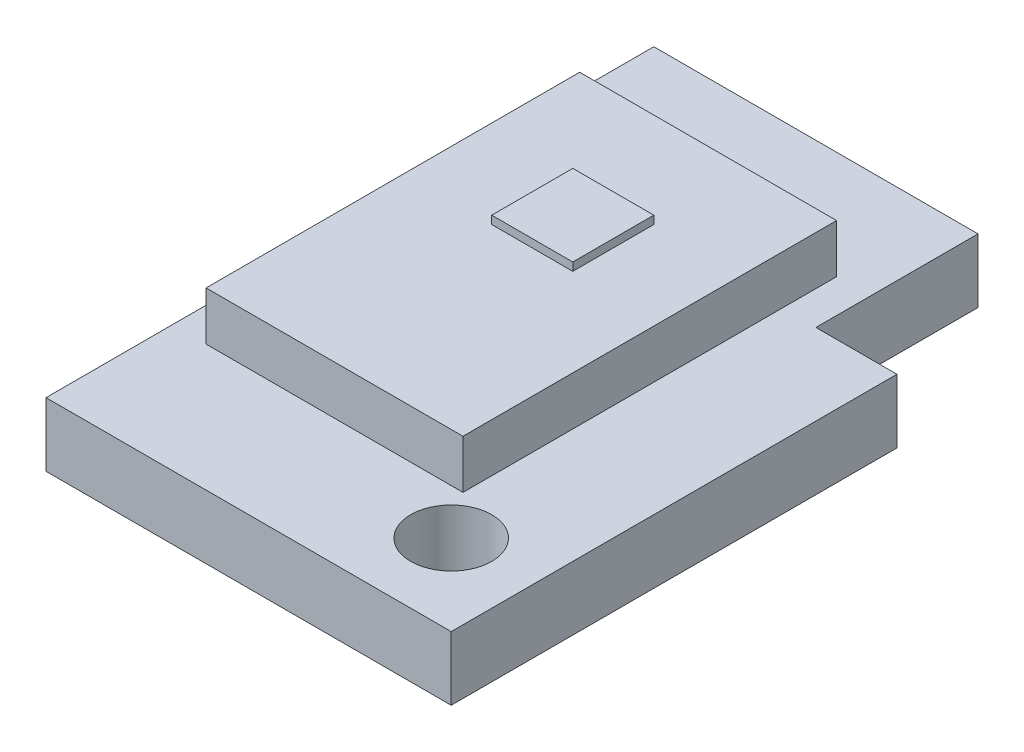
ISO-10303-21;
HEADER;
FILE_DESCRIPTION(('STEP AP214'),'2;1');
FILE_NAME('part.step','',(''),(''),'','','');
FILE_SCHEMA(('AUTOMOTIVE_DESIGN { 1 0 10303 214 1 1 1 1 }'));
ENDSEC;
DATA;
#1=APPLICATION_CONTEXT('core data for automotive mechanical design processes');
#2=APPLICATION_PROTOCOL_DEFINITION('international standard','automotive_design',2000,#1);
#3=PRODUCT_CONTEXT('',#1,'mechanical');
#4=PRODUCT('Part','Part','',(#3));
#5=PRODUCT_RELATED_PRODUCT_CATEGORY('part','',(#4));
#6=PRODUCT_DEFINITION_FORMATION('','',#4);
#7=PRODUCT_DEFINITION_CONTEXT('part definition',#1,'design');
#8=PRODUCT_DEFINITION('design','',#6,#7);
#9=PRODUCT_DEFINITION_SHAPE('','',#8);
#10=(LENGTH_UNIT() NAMED_UNIT(*) SI_UNIT(.MILLI.,.METRE.));
#11=(NAMED_UNIT(*) PLANE_ANGLE_UNIT() SI_UNIT($,.RADIAN.));
#12=(NAMED_UNIT(*) SI_UNIT($,.STERADIAN.) SOLID_ANGLE_UNIT());
#13=UNCERTAINTY_MEASURE_WITH_UNIT(LENGTH_MEASURE(1.E-05),#10,'distance_accuracy_value','');
#14=(GEOMETRIC_REPRESENTATION_CONTEXT(3) GLOBAL_UNCERTAINTY_ASSIGNED_CONTEXT((#13)) GLOBAL_UNIT_ASSIGNED_CONTEXT((#10,
#11,#12)) REPRESENTATION_CONTEXT('',''));
#15=CARTESIAN_POINT('',(0.,0.,0.));
#16=DIRECTION('',(0.,0.,1.));
#17=DIRECTION('',(1.,0.,0.));
#18=AXIS2_PLACEMENT_3D('',#15,#16,#17);
#19=CARTESIAN_POINT('',(0.,1.3874,0.));
#20=DIRECTION('',(0.,1.,0.));
#21=DIRECTION('',(0.,0.,1.));
#22=AXIS2_PLACEMENT_3D('',#19,#20,#21);
#23=PLANE('',#22);
#24=DIRECTION('',(0.,0.,1.));
#25=VECTOR('',#24,1.);
#26=CARTESIAN_POINT('',(-1.585,1.3874,2.94));
#27=LINE('',#26,#25);
#28=CARTESIAN_POINT('',(-1.585,1.3874,-1.67));
#29=VERTEX_POINT('',#28);
#30=CARTESIAN_POINT('',(-1.585,1.3874,2.94));
#31=VERTEX_POINT('',#30);
#32=EDGE_CURVE('E166',#29,#31,#27,.T.);
#33=ORIENTED_EDGE('',*,*,#32,.T.);
#34=DIRECTION('',(1.,0.,0.));
#35=VECTOR('',#34,1.);
#36=CARTESIAN_POINT('',(1.585,1.3874,2.94));
#37=LINE('',#36,#35);
#38=CARTESIAN_POINT('',(1.585,1.3874,2.94));
#39=VERTEX_POINT('',#38);
#40=EDGE_CURVE('E169',#31,#39,#37,.T.);
#41=ORIENTED_EDGE('',*,*,#40,.T.);
#42=DIRECTION('',(0.,0.,-1.));
#43=VECTOR('',#42,1.);
#44=CARTESIAN_POINT('',(1.585,1.3874,2.94));
#45=LINE('',#44,#43);
#46=CARTESIAN_POINT('',(1.585,1.3874,-1.67));
#47=VERTEX_POINT('',#46);
#48=EDGE_CURVE('E172',#39,#47,#45,.T.);
#49=ORIENTED_EDGE('',*,*,#48,.T.);
#50=DIRECTION('',(-1.,0.,0.));
#51=VECTOR('',#50,1.);
#52=CARTESIAN_POINT('',(1.585,1.3874,-1.67));
#53=LINE('',#52,#51);
#54=EDGE_CURVE('E174',#47,#29,#53,.T.);
#55=ORIENTED_EDGE('',*,*,#54,.T.);
#56=EDGE_LOOP('',(#33,#41,#49,#55));
#57=FACE_BOUND('',#56,.T.);
#58=DIRECTION('',(-1.,0.,0.));
#59=VECTOR('',#58,1.);
#60=CARTESIAN_POINT('',(-0.500000000000001,1.3874,-0.5));
#61=LINE('',#60,#59);
#62=CARTESIAN_POINT('',(0.499999999999999,1.3874,-0.5));
#63=VERTEX_POINT('',#62);
#64=CARTESIAN_POINT('',(-0.500000000000001,1.3874,-0.5));
#65=VERTEX_POINT('',#64);
#66=EDGE_CURVE('E450',#63,#65,#61,.T.);
#67=ORIENTED_EDGE('',*,*,#66,.F.);
#68=DIRECTION('',(0.,0.,-1.));
#69=VECTOR('',#68,1.);
#70=CARTESIAN_POINT('',(0.499999999999999,1.3874,0.5));
#71=LINE('',#70,#69);
#72=CARTESIAN_POINT('',(0.499999999999999,1.3874,0.5));
#73=VERTEX_POINT('',#72);
#74=EDGE_CURVE('E157',#73,#63,#71,.T.);
#75=ORIENTED_EDGE('',*,*,#74,.F.);
#76=DIRECTION('',(1.,0.,0.));
#77=VECTOR('',#76,1.);
#78=CARTESIAN_POINT('',(-0.500000000000001,1.3874,0.5));
#79=LINE('',#78,#77);
#80=CARTESIAN_POINT('',(-0.500000000000001,1.3874,0.5));
#81=VERTEX_POINT('',#80);
#82=EDGE_CURVE('E153',#81,#73,#79,.T.);
#83=ORIENTED_EDGE('',*,*,#82,.F.);
#84=DIRECTION('',(0.,0.,1.));
#85=VECTOR('',#84,1.);
#86=CARTESIAN_POINT('',(-0.500000000000001,1.3874,0.5));
#87=LINE('',#86,#85);
#88=EDGE_CURVE('E452',#65,#81,#87,.T.);
#89=ORIENTED_EDGE('',*,*,#88,.F.);
#90=EDGE_LOOP('',(#67,#75,#83,#89));
#91=FACE_BOUND('',#90,.T.);
#92=ADVANCED_FACE('F33',(#57,#91),#23,.T.);
#93=CARTESIAN_POINT('',(0.,0.7874,0.));
#94=DIRECTION('',(0.,-1.,0.));
#95=DIRECTION('',(0.,0.,-1.));
#96=AXIS2_PLACEMENT_3D('',#93,#94,#95);
#97=PLANE('',#96);
#98=CARTESIAN_POINT('',(2.,0.7874,3.5));
#99=DIRECTION('',(0.,1.,0.));
#100=DIRECTION('',(0.,0.,1.));
#101=AXIS2_PLACEMENT_3D('',#98,#99,#100);
#102=CIRCLE('',#101,0.5);
#103=CARTESIAN_POINT('',(2.,0.7874,4.));
#104=VERTEX_POINT('',#103);
#105=EDGE_CURVE('E442',#104,#104,#102,.T.);
#106=ORIENTED_EDGE('',*,*,#105,.F.);
#107=EDGE_LOOP('',(#106));
#108=FACE_BOUND('',#107,.T.);
#109=DIRECTION('',(0.,0.,1.));
#110=VECTOR('',#109,1.);
#111=CARTESIAN_POINT('',(-2.,0.7874,-3.));
#112=LINE('',#111,#110);
#113=CARTESIAN_POINT('',(-2.,0.7874,-3.));
#114=VERTEX_POINT('',#113);
#115=CARTESIAN_POINT('',(-2.,0.7874,4.5));
#116=VERTEX_POINT('',#115);
#117=EDGE_CURVE('E194',#114,#116,#112,.T.);
#118=ORIENTED_EDGE('',*,*,#117,.T.);
#119=DIRECTION('',(1.,0.,0.));
#120=VECTOR('',#119,1.);
#121=CARTESIAN_POINT('',(3.,0.7874,4.5));
#122=LINE('',#121,#120);
#123=CARTESIAN_POINT('',(3.,0.7874,4.5));
#124=VERTEX_POINT('',#123);
#125=EDGE_CURVE('E197',#116,#124,#122,.T.);
#126=ORIENTED_EDGE('',*,*,#125,.T.);
#127=DIRECTION('',(0.,0.,-1.));
#128=VECTOR('',#127,1.);
#129=CARTESIAN_POINT('',(3.,0.7874,-1.));
#130=LINE('',#129,#128);
#131=CARTESIAN_POINT('',(3.,0.7874,-1.));
#132=VERTEX_POINT('',#131);
#133=EDGE_CURVE('E200',#124,#132,#130,.T.);
#134=ORIENTED_EDGE('',*,*,#133,.T.);
#135=DIRECTION('',(-1.,0.,0.));
#136=VECTOR('',#135,1.);
#137=CARTESIAN_POINT('',(2.,0.7874,-1.));
#138=LINE('',#137,#136);
#139=CARTESIAN_POINT('',(2.,0.7874,-1.));
#140=VERTEX_POINT('',#139);
#141=EDGE_CURVE('E202',#132,#140,#138,.T.);
#142=ORIENTED_EDGE('',*,*,#141,.T.);
#143=DIRECTION('',(0.,0.,-1.));
#144=VECTOR('',#143,1.);
#145=CARTESIAN_POINT('',(2.,0.7874,-3.));
#146=LINE('',#145,#144);
#147=CARTESIAN_POINT('',(2.,0.7874,-3.));
#148=VERTEX_POINT('',#147);
#149=EDGE_CURVE('E204',#140,#148,#146,.T.);
#150=ORIENTED_EDGE('',*,*,#149,.T.);
#151=DIRECTION('',(-1.,0.,0.));
#152=VECTOR('',#151,1.);
#153=CARTESIAN_POINT('',(2.,0.7874,-3.));
#154=LINE('',#153,#152);
#155=EDGE_CURVE('E206',#148,#114,#154,.T.);
#156=ORIENTED_EDGE('',*,*,#155,.T.);
#157=EDGE_LOOP('',(#118,#126,#134,#142,#150,#156));
#158=FACE_BOUND('',#157,.T.);
#159=DIRECTION('',(0.,0.,1.));
#160=VECTOR('',#159,1.);
#161=CARTESIAN_POINT('',(-1.585,0.7874,2.94));
#162=LINE('',#161,#160);
#163=CARTESIAN_POINT('',(-1.585,0.7874,-1.67));
#164=VERTEX_POINT('',#163);
#165=CARTESIAN_POINT('',(-1.585,0.7874,2.94));
#166=VERTEX_POINT('',#165);
#167=EDGE_CURVE('E159',#164,#166,#162,.T.);
#168=ORIENTED_EDGE('',*,*,#167,.F.);
#169=DIRECTION('',(-1.,0.,0.));
#170=VECTOR('',#169,1.);
#171=CARTESIAN_POINT('',(1.585,0.7874,-1.67));
#172=LINE('',#171,#170);
#173=CARTESIAN_POINT('',(1.585,0.7874,-1.67));
#174=VERTEX_POINT('',#173);
#175=EDGE_CURVE('E170',#174,#164,#172,.T.);
#176=ORIENTED_EDGE('',*,*,#175,.F.);
#177=DIRECTION('',(0.,0.,-1.));
#178=VECTOR('',#177,1.);
#179=CARTESIAN_POINT('',(1.585,0.7874,2.94));
#180=LINE('',#179,#178);
#181=CARTESIAN_POINT('',(1.585,0.7874,2.94));
#182=VERTEX_POINT('',#181);
#183=EDGE_CURVE('E178',#182,#174,#180,.T.);
#184=ORIENTED_EDGE('',*,*,#183,.F.);
#185=DIRECTION('',(1.,0.,0.));
#186=VECTOR('',#185,1.);
#187=CARTESIAN_POINT('',(1.585,0.7874,2.94));
#188=LINE('',#187,#186);
#189=EDGE_CURVE('E56',#166,#182,#188,.T.);
#190=ORIENTED_EDGE('',*,*,#189,.F.);
#191=EDGE_LOOP('',(#168,#176,#184,#190));
#192=FACE_BOUND('',#191,.T.);
#193=ADVANCED_FACE('F254',(#108,#158,#192),#97,.F.);
#194=CARTESIAN_POINT('',(-2.,0.7874,-3.));
#195=DIRECTION('',(1.,0.,0.));
#196=DIRECTION('',(0.,0.,-1.));
#197=AXIS2_PLACEMENT_3D('',#194,#195,#196);
#198=PLANE('',#197);
#199=DIRECTION('',(0.,0.,1.));
#200=VECTOR('',#199,1.);
#201=CARTESIAN_POINT('',(-2.,0.,-3.));
#202=LINE('',#201,#200);
#203=CARTESIAN_POINT('',(-2.,0.,-3.));
#204=VERTEX_POINT('',#203);
#205=CARTESIAN_POINT('',(-2.,0.,4.5));
#206=VERTEX_POINT('',#205);
#207=EDGE_CURVE('E193',#204,#206,#202,.T.);
#208=ORIENTED_EDGE('',*,*,#207,.T.);
#209=DIRECTION('',(0.,-1.,0.));
#210=VECTOR('',#209,1.);
#211=CARTESIAN_POINT('',(-2.,0.7874,4.5));
#212=LINE('',#211,#210);
#213=EDGE_CURVE('E11',#116,#206,#212,.T.);
#214=ORIENTED_EDGE('',*,*,#213,.F.);
#215=ORIENTED_EDGE('',*,*,#117,.F.);
#216=DIRECTION('',(0.,-1.,0.));
#217=VECTOR('',#216,1.);
#218=CARTESIAN_POINT('',(-2.,0.7874,-3.));
#219=LINE('',#218,#217);
#220=EDGE_CURVE('E208',#114,#204,#219,.T.);
#221=ORIENTED_EDGE('',*,*,#220,.T.);
#222=EDGE_LOOP('',(#208,#214,#215,#221));
#223=FACE_BOUND('',#222,.T.);
#224=ADVANCED_FACE('F35',(#223),#198,.F.);
#225=CARTESIAN_POINT('',(3.,0.7874,4.5));
#226=DIRECTION('',(0.,0.,-1.));
#227=DIRECTION('',(-1.,0.,0.));
#228=AXIS2_PLACEMENT_3D('',#225,#226,#227);
#229=PLANE('',#228);
#230=DIRECTION('',(1.,0.,0.));
#231=VECTOR('',#230,1.);
#232=CARTESIAN_POINT('',(3.,0.,4.5));
#233=LINE('',#232,#231);
#234=CARTESIAN_POINT('',(3.,0.,4.5));
#235=VERTEX_POINT('',#234);
#236=EDGE_CURVE('E211',#206,#235,#233,.T.);
#237=ORIENTED_EDGE('',*,*,#236,.T.);
#238=DIRECTION('',(0.,-1.,0.));
#239=VECTOR('',#238,1.);
#240=CARTESIAN_POINT('',(3.,0.7874,4.5));
#241=LINE('',#240,#239);
#242=EDGE_CURVE('E41',#124,#235,#241,.T.);
#243=ORIENTED_EDGE('',*,*,#242,.F.);
#244=ORIENTED_EDGE('',*,*,#125,.F.);
#245=ORIENTED_EDGE('',*,*,#213,.T.);
#246=EDGE_LOOP('',(#237,#243,#244,#245));
#247=FACE_BOUND('',#246,.T.);
#248=ADVANCED_FACE('F258',(#247),#229,.F.);
#249=CARTESIAN_POINT('',(3.,0.7874,-1.));
#250=DIRECTION('',(-1.,0.,0.));
#251=DIRECTION('',(0.,0.,1.));
#252=AXIS2_PLACEMENT_3D('',#249,#250,#251);
#253=PLANE('',#252);
#254=DIRECTION('',(0.,0.,-1.));
#255=VECTOR('',#254,1.);
#256=CARTESIAN_POINT('',(3.,0.,-1.));
#257=LINE('',#256,#255);
#258=CARTESIAN_POINT('',(3.,0.,-1.));
#259=VERTEX_POINT('',#258);
#260=EDGE_CURVE('E213',#235,#259,#257,.T.);
#261=ORIENTED_EDGE('',*,*,#260,.T.);
#262=DIRECTION('',(0.,-1.,0.));
#263=VECTOR('',#262,1.);
#264=CARTESIAN_POINT('',(3.,0.7874,-1.));
#265=LINE('',#264,#263);
#266=EDGE_CURVE('E228',#132,#259,#265,.T.);
#267=ORIENTED_EDGE('',*,*,#266,.F.);
#268=ORIENTED_EDGE('',*,*,#133,.F.);
#269=ORIENTED_EDGE('',*,*,#242,.T.);
#270=EDGE_LOOP('',(#261,#267,#268,#269));
#271=FACE_BOUND('',#270,.T.);
#272=ADVANCED_FACE('F235',(#271),#253,.F.);
#273=CARTESIAN_POINT('',(2.,0.7874,-1.));
#274=DIRECTION('',(0.,0.,1.));
#275=DIRECTION('',(1.,0.,0.));
#276=AXIS2_PLACEMENT_3D('',#273,#274,#275);
#277=PLANE('',#276);
#278=DIRECTION('',(-1.,0.,0.));
#279=VECTOR('',#278,1.);
#280=CARTESIAN_POINT('',(2.,0.,-1.));
#281=LINE('',#280,#279);
#282=CARTESIAN_POINT('',(2.,0.,-1.));
#283=VERTEX_POINT('',#282);
#284=EDGE_CURVE('E215',#259,#283,#281,.T.);
#285=ORIENTED_EDGE('',*,*,#284,.T.);
#286=DIRECTION('',(0.,-1.,0.));
#287=VECTOR('',#286,1.);
#288=CARTESIAN_POINT('',(2.,0.7874,-1.));
#289=LINE('',#288,#287);
#290=EDGE_CURVE('E225',#140,#283,#289,.T.);
#291=ORIENTED_EDGE('',*,*,#290,.F.);
#292=ORIENTED_EDGE('',*,*,#141,.F.);
#293=ORIENTED_EDGE('',*,*,#266,.T.);
#294=EDGE_LOOP('',(#285,#291,#292,#293));
#295=FACE_BOUND('',#294,.T.);
#296=ADVANCED_FACE('F246',(#295),#277,.F.);
#297=CARTESIAN_POINT('',(2.,0.7874,-3.));
#298=DIRECTION('',(-1.,0.,0.));
#299=DIRECTION('',(0.,0.,1.));
#300=AXIS2_PLACEMENT_3D('',#297,#298,#299);
#301=PLANE('',#300);
#302=DIRECTION('',(0.,0.,-1.));
#303=VECTOR('',#302,1.);
#304=CARTESIAN_POINT('',(2.,0.,-3.));
#305=LINE('',#304,#303);
#306=CARTESIAN_POINT('',(2.,0.,-3.));
#307=VERTEX_POINT('',#306);
#308=EDGE_CURVE('E217',#283,#307,#305,.T.);
#309=ORIENTED_EDGE('',*,*,#308,.T.);
#310=DIRECTION('',(0.,-1.,0.));
#311=VECTOR('',#310,1.);
#312=CARTESIAN_POINT('',(2.,0.7874,-3.));
#313=LINE('',#312,#311);
#314=EDGE_CURVE('E222',#148,#307,#313,.T.);
#315=ORIENTED_EDGE('',*,*,#314,.F.);
#316=ORIENTED_EDGE('',*,*,#149,.F.);
#317=ORIENTED_EDGE('',*,*,#290,.T.);
#318=EDGE_LOOP('',(#309,#315,#316,#317));
#319=FACE_BOUND('',#318,.T.);
#320=ADVANCED_FACE('F250',(#319),#301,.F.);
#321=CARTESIAN_POINT('',(2.,0.7874,-3.));
#322=DIRECTION('',(0.,0.,1.));
#323=DIRECTION('',(1.,0.,0.));
#324=AXIS2_PLACEMENT_3D('',#321,#322,#323);
#325=PLANE('',#324);
#326=DIRECTION('',(-1.,0.,0.));
#327=VECTOR('',#326,1.);
#328=CARTESIAN_POINT('',(2.,0.,-3.));
#329=LINE('',#328,#327);
#330=EDGE_CURVE('E198',#307,#204,#329,.T.);
#331=ORIENTED_EDGE('',*,*,#330,.T.);
#332=ORIENTED_EDGE('',*,*,#220,.F.);
#333=ORIENTED_EDGE('',*,*,#155,.F.);
#334=ORIENTED_EDGE('',*,*,#314,.T.);
#335=EDGE_LOOP('',(#331,#332,#333,#334));
#336=FACE_BOUND('',#335,.T.);
#337=ADVANCED_FACE('F261',(#336),#325,.F.);
#338=CARTESIAN_POINT('',(0.,0.,0.));
#339=DIRECTION('',(0.,-1.,0.));
#340=DIRECTION('',(0.,0.,-1.));
#341=AXIS2_PLACEMENT_3D('',#338,#339,#340);
#342=PLANE('',#341);
#343=CARTESIAN_POINT('',(2.,0.,3.5));
#344=DIRECTION('',(0.,1.,0.));
#345=DIRECTION('',(0.,0.,1.));
#346=AXIS2_PLACEMENT_3D('',#343,#344,#345);
#347=CIRCLE('',#346,0.5);
#348=CARTESIAN_POINT('',(2.,0.,4.));
#349=VERTEX_POINT('',#348);
#350=EDGE_CURVE('E439',#349,#349,#347,.T.);
#351=ORIENTED_EDGE('',*,*,#350,.T.);
#352=EDGE_LOOP('',(#351));
#353=FACE_BOUND('',#352,.T.);
#354=ORIENTED_EDGE('',*,*,#207,.F.);
#355=ORIENTED_EDGE('',*,*,#330,.F.);
#356=ORIENTED_EDGE('',*,*,#308,.F.);
#357=ORIENTED_EDGE('',*,*,#284,.F.);
#358=ORIENTED_EDGE('',*,*,#260,.F.);
#359=ORIENTED_EDGE('',*,*,#236,.F.);
#360=EDGE_LOOP('',(#354,#355,#356,#357,#358,#359));
#361=FACE_BOUND('',#360,.T.);
#362=ADVANCED_FACE('F241',(#353,#361),#342,.T.);
#363=CARTESIAN_POINT('',(-1.585,1.3874,2.94));
#364=DIRECTION('',(1.,0.,0.));
#365=DIRECTION('',(0.,0.,-1.));
#366=AXIS2_PLACEMENT_3D('',#363,#364,#365);
#367=PLANE('',#366);
#368=ORIENTED_EDGE('',*,*,#167,.T.);
#369=DIRECTION('',(0.,-1.,0.));
#370=VECTOR('',#369,1.);
#371=CARTESIAN_POINT('',(-1.585,1.3874,2.94));
#372=LINE('',#371,#370);
#373=EDGE_CURVE('E191',#31,#166,#372,.T.);
#374=ORIENTED_EDGE('',*,*,#373,.F.);
#375=ORIENTED_EDGE('',*,*,#32,.F.);
#376=DIRECTION('',(0.,-1.,0.));
#377=VECTOR('',#376,1.);
#378=CARTESIAN_POINT('',(-1.585,1.3874,-1.67));
#379=LINE('',#378,#377);
#380=EDGE_CURVE('E175',#29,#164,#379,.T.);
#381=ORIENTED_EDGE('',*,*,#380,.T.);
#382=EDGE_LOOP('',(#368,#374,#375,#381));
#383=FACE_BOUND('',#382,.T.);
#384=ADVANCED_FACE('F268',(#383),#367,.F.);
#385=CARTESIAN_POINT('',(1.585,1.3874,2.94));
#386=DIRECTION('',(0.,0.,-1.));
#387=DIRECTION('',(-1.,0.,0.));
#388=AXIS2_PLACEMENT_3D('',#385,#386,#387);
#389=PLANE('',#388);
#390=ORIENTED_EDGE('',*,*,#189,.T.);
#391=DIRECTION('',(0.,-1.,0.));
#392=VECTOR('',#391,1.);
#393=CARTESIAN_POINT('',(1.585,1.3874,2.94));
#394=LINE('',#393,#392);
#395=EDGE_CURVE('E188',#39,#182,#394,.T.);
#396=ORIENTED_EDGE('',*,*,#395,.F.);
#397=ORIENTED_EDGE('',*,*,#40,.F.);
#398=ORIENTED_EDGE('',*,*,#373,.T.);
#399=EDGE_LOOP('',(#390,#396,#397,#398));
#400=FACE_BOUND('',#399,.T.);
#401=ADVANCED_FACE('F291',(#400),#389,.F.);
#402=CARTESIAN_POINT('',(1.585,1.3874,2.94));
#403=DIRECTION('',(-1.,0.,0.));
#404=DIRECTION('',(0.,0.,1.));
#405=AXIS2_PLACEMENT_3D('',#402,#403,#404);
#406=PLANE('',#405);
#407=ORIENTED_EDGE('',*,*,#183,.T.);
#408=DIRECTION('',(0.,-1.,0.));
#409=VECTOR('',#408,1.);
#410=CARTESIAN_POINT('',(1.585,1.3874,-1.67));
#411=LINE('',#410,#409);
#412=EDGE_CURVE('E185',#47,#174,#411,.T.);
#413=ORIENTED_EDGE('',*,*,#412,.F.);
#414=ORIENTED_EDGE('',*,*,#48,.F.);
#415=ORIENTED_EDGE('',*,*,#395,.T.);
#416=EDGE_LOOP('',(#407,#413,#414,#415));
#417=FACE_BOUND('',#416,.T.);
#418=ADVANCED_FACE('F287',(#417),#406,.F.);
#419=CARTESIAN_POINT('',(1.585,1.3874,-1.67));
#420=DIRECTION('',(0.,0.,1.));
#421=DIRECTION('',(1.,0.,0.));
#422=AXIS2_PLACEMENT_3D('',#419,#420,#421);
#423=PLANE('',#422);
#424=ORIENTED_EDGE('',*,*,#175,.T.);
#425=ORIENTED_EDGE('',*,*,#380,.F.);
#426=ORIENTED_EDGE('',*,*,#54,.F.);
#427=ORIENTED_EDGE('',*,*,#412,.T.);
#428=EDGE_LOOP('',(#424,#425,#426,#427));
#429=FACE_BOUND('',#428,.T.);
#430=ADVANCED_FACE('F284',(#429),#423,.F.);
#431=CARTESIAN_POINT('',(0.499999999999999,1.4874,0.5));
#432=DIRECTION('',(-1.,0.,0.));
#433=DIRECTION('',(0.,0.,1.));
#434=AXIS2_PLACEMENT_3D('',#431,#432,#433);
#435=PLANE('',#434);
#436=ORIENTED_EDGE('',*,*,#74,.T.);
#437=DIRECTION('',(0.,-1.,0.));
#438=VECTOR('',#437,1.);
#439=CARTESIAN_POINT('',(0.499999999999999,1.4874,-0.5));
#440=LINE('',#439,#438);
#441=CARTESIAN_POINT('',(0.499999999999999,1.4874,-0.5));
#442=VERTEX_POINT('',#441);
#443=EDGE_CURVE('E138',#442,#63,#440,.T.);
#444=ORIENTED_EDGE('',*,*,#443,.F.);
#445=DIRECTION('',(0.,0.,-1.));
#446=VECTOR('',#445,1.);
#447=CARTESIAN_POINT('',(0.499999999999999,1.4874,0.5));
#448=LINE('',#447,#446);
#449=CARTESIAN_POINT('',(0.499999999999999,1.4874,0.5));
#450=VERTEX_POINT('',#449);
#451=EDGE_CURVE('E145',#450,#442,#448,.T.);
#452=ORIENTED_EDGE('',*,*,#451,.F.);
#453=DIRECTION('',(0.,-1.,0.));
#454=VECTOR('',#453,1.);
#455=CARTESIAN_POINT('',(0.499999999999999,1.4874,0.5));
#456=LINE('',#455,#454);
#457=EDGE_CURVE('E448',#450,#73,#456,.T.);
#458=ORIENTED_EDGE('',*,*,#457,.T.);
#459=EDGE_LOOP('',(#436,#444,#452,#458));
#460=FACE_BOUND('',#459,.T.);
#461=ADVANCED_FACE('F155',(#460),#435,.F.);
#462=CARTESIAN_POINT('',(-0.500000000000001,1.4874,-0.5));
#463=DIRECTION('',(0.,0.,1.));
#464=DIRECTION('',(1.,0.,0.));
#465=AXIS2_PLACEMENT_3D('',#462,#463,#464);
#466=PLANE('',#465);
#467=ORIENTED_EDGE('',*,*,#66,.T.);
#468=DIRECTION('',(0.,-1.,0.));
#469=VECTOR('',#468,1.);
#470=CARTESIAN_POINT('',(-0.500000000000001,1.4874,-0.5));
#471=LINE('',#470,#469);
#472=CARTESIAN_POINT('',(-0.500000000000001,1.4874,-0.5));
#473=VERTEX_POINT('',#472);
#474=EDGE_CURVE('E141',#473,#65,#471,.T.);
#475=ORIENTED_EDGE('',*,*,#474,.F.);
#476=DIRECTION('',(-1.,0.,0.));
#477=VECTOR('',#476,1.);
#478=CARTESIAN_POINT('',(-0.500000000000001,1.4874,-0.5));
#479=LINE('',#478,#477);
#480=EDGE_CURVE('E134',#442,#473,#479,.T.);
#481=ORIENTED_EDGE('',*,*,#480,.F.);
#482=ORIENTED_EDGE('',*,*,#443,.T.);
#483=EDGE_LOOP('',(#467,#475,#481,#482));
#484=FACE_BOUND('',#483,.T.);
#485=ADVANCED_FACE('F136',(#484),#466,.F.);
#486=CARTESIAN_POINT('',(-0.500000000000001,1.4874,0.5));
#487=DIRECTION('',(1.,0.,0.));
#488=DIRECTION('',(0.,0.,-1.));
#489=AXIS2_PLACEMENT_3D('',#486,#487,#488);
#490=PLANE('',#489);
#491=ORIENTED_EDGE('',*,*,#88,.T.);
#492=DIRECTION('',(0.,-1.,0.));
#493=VECTOR('',#492,1.);
#494=CARTESIAN_POINT('',(-0.500000000000001,1.4874,0.5));
#495=LINE('',#494,#493);
#496=CARTESIAN_POINT('',(-0.500000000000001,1.4874,0.5));
#497=VERTEX_POINT('',#496);
#498=EDGE_CURVE('E48',#497,#81,#495,.T.);
#499=ORIENTED_EDGE('',*,*,#498,.F.);
#500=DIRECTION('',(0.,0.,1.));
#501=VECTOR('',#500,1.);
#502=CARTESIAN_POINT('',(-0.500000000000001,1.4874,0.5));
#503=LINE('',#502,#501);
#504=EDGE_CURVE('E144',#473,#497,#503,.T.);
#505=ORIENTED_EDGE('',*,*,#504,.F.);
#506=ORIENTED_EDGE('',*,*,#474,.T.);
#507=EDGE_LOOP('',(#491,#499,#505,#506));
#508=FACE_BOUND('',#507,.T.);
#509=ADVANCED_FACE('F332',(#508),#490,.F.);
#510=CARTESIAN_POINT('',(-0.500000000000001,1.4874,0.5));
#511=DIRECTION('',(0.,0.,-1.));
#512=DIRECTION('',(-1.,0.,0.));
#513=AXIS2_PLACEMENT_3D('',#510,#511,#512);
#514=PLANE('',#513);
#515=ORIENTED_EDGE('',*,*,#82,.T.);
#516=ORIENTED_EDGE('',*,*,#457,.F.);
#517=DIRECTION('',(1.,0.,0.));
#518=VECTOR('',#517,1.);
#519=CARTESIAN_POINT('',(-0.500000000000001,1.4874,0.5));
#520=LINE('',#519,#518);
#521=EDGE_CURVE('E149',#497,#450,#520,.T.);
#522=ORIENTED_EDGE('',*,*,#521,.F.);
#523=ORIENTED_EDGE('',*,*,#498,.T.);
#524=EDGE_LOOP('',(#515,#516,#522,#523));
#525=FACE_BOUND('',#524,.T.);
#526=ADVANCED_FACE('F338',(#525),#514,.F.);
#527=CARTESIAN_POINT('',(0.,1.4874,0.));
#528=DIRECTION('',(0.,-1.,0.));
#529=DIRECTION('',(0.,0.,-1.));
#530=AXIS2_PLACEMENT_3D('',#527,#528,#529);
#531=PLANE('',#530);
#532=ORIENTED_EDGE('',*,*,#451,.T.);
#533=ORIENTED_EDGE('',*,*,#480,.T.);
#534=ORIENTED_EDGE('',*,*,#504,.T.);
#535=ORIENTED_EDGE('',*,*,#521,.T.);
#536=EDGE_LOOP('',(#532,#533,#534,#535));
#537=FACE_BOUND('',#536,.T.);
#538=ADVANCED_FACE('F148',(#537),#531,.F.);
#539=CARTESIAN_POINT('',(2.,0.,3.5));
#540=DIRECTION('',(0.,1.,0.));
#541=DIRECTION('',(0.,0.,1.));
#542=AXIS2_PLACEMENT_3D('',#539,#540,#541);
#543=CYLINDRICAL_SURFACE('',#542,0.5);
#544=ORIENTED_EDGE('',*,*,#350,.F.);
#545=EDGE_LOOP('',(#544));
#546=FACE_BOUND('',#545,.T.);
#547=ORIENTED_EDGE('',*,*,#105,.T.);
#548=EDGE_LOOP('',(#547));
#549=FACE_BOUND('',#548,.T.);
#550=ADVANCED_FACE('F352',(#546,#549),#543,.F.);
#551=CLOSED_SHELL('',(#92,#193,#224,#248,#272,#296,#320,#337,#362,#384,#401,#418,#430,#461,#485,
#509,#526,#538,#550));
#552=MANIFOLD_SOLID_BREP('B2',#551);
#553=ADVANCED_BREP_SHAPE_REPRESENTATION('',(#18,#552),#14);
#554=SHAPE_DEFINITION_REPRESENTATION(#9,#553);
ENDSEC;
END-ISO-10303-21;
